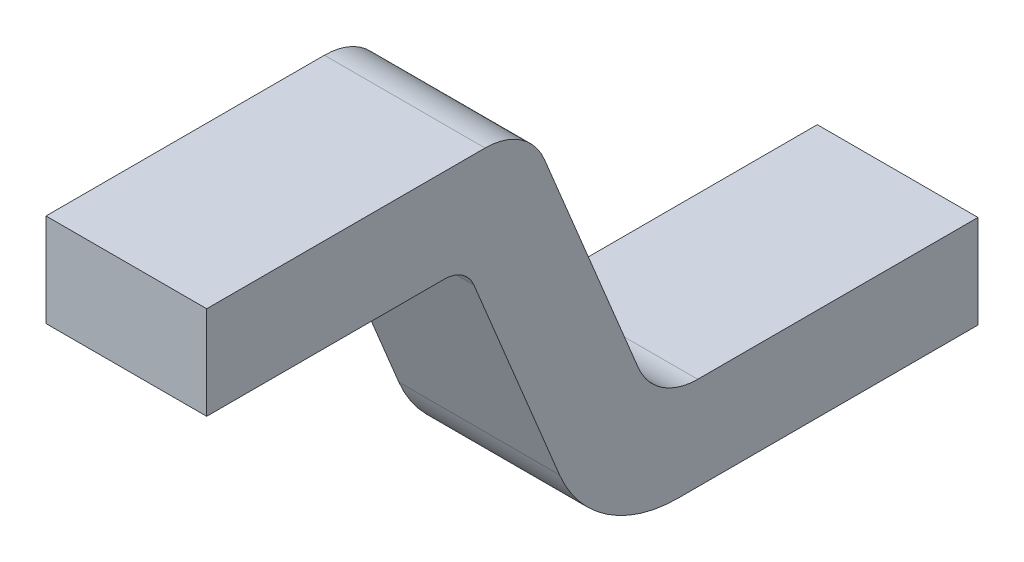
ISO-10303-21;
HEADER;
FILE_DESCRIPTION(('STEP AP214'),'2;1');
FILE_NAME('part.step','',(''),(''),'','','');
FILE_SCHEMA(('AUTOMOTIVE_DESIGN { 1 0 10303 214 1 1 1 1 }'));
ENDSEC;
DATA;
#1=APPLICATION_CONTEXT('core data for automotive mechanical design processes');
#2=APPLICATION_PROTOCOL_DEFINITION('international standard','automotive_design',2000,#1);
#3=PRODUCT_CONTEXT('',#1,'mechanical');
#4=PRODUCT('Part','Part','',(#3));
#5=PRODUCT_RELATED_PRODUCT_CATEGORY('part','',(#4));
#6=PRODUCT_DEFINITION_FORMATION('','',#4);
#7=PRODUCT_DEFINITION_CONTEXT('part definition',#1,'design');
#8=PRODUCT_DEFINITION('design','',#6,#7);
#9=PRODUCT_DEFINITION_SHAPE('','',#8);
#10=(LENGTH_UNIT() NAMED_UNIT(*) SI_UNIT(.MILLI.,.METRE.));
#11=(NAMED_UNIT(*) PLANE_ANGLE_UNIT() SI_UNIT($,.RADIAN.));
#12=(NAMED_UNIT(*) SI_UNIT($,.STERADIAN.) SOLID_ANGLE_UNIT());
#13=UNCERTAINTY_MEASURE_WITH_UNIT(LENGTH_MEASURE(1.E-05),#10,'distance_accuracy_value','');
#14=(GEOMETRIC_REPRESENTATION_CONTEXT(3) GLOBAL_UNCERTAINTY_ASSIGNED_CONTEXT((#13)) GLOBAL_UNIT_ASSIGNED_CONTEXT((#10,
#11,#12)) REPRESENTATION_CONTEXT('',''));
#15=CARTESIAN_POINT('',(0.,0.,0.));
#16=DIRECTION('',(0.,0.,1.));
#17=DIRECTION('',(1.,0.,0.));
#18=AXIS2_PLACEMENT_3D('',#15,#16,#17);
#19=CARTESIAN_POINT('',(0.25,-0.145,-0.169557608881));
#20=DIRECTION('',(0.,1.,0.));
#21=DIRECTION('',(0.,0.,-1.));
#22=AXIS2_PLACEMENT_3D('',#19,#20,#21);
#23=PLANE('',#22);
#24=DIRECTION('',(0.,0.,-1.));
#25=VECTOR('',#24,1.);
#26=CARTESIAN_POINT('',(0.,-0.145,-0.169557608881));
#27=LINE('',#26,#25);
#28=CARTESIAN_POINT('',(0.,-0.145,0.2));
#29=VERTEX_POINT('',#28);
#30=CARTESIAN_POINT('',(0.,-0.145,-0.169557608881));
#31=VERTEX_POINT('',#30);
#32=EDGE_CURVE('E11',#29,#31,#27,.T.);
#33=ORIENTED_EDGE('',*,*,#32,.T.);
#34=DIRECTION('',(-1.,0.,0.));
#35=VECTOR('',#34,1.);
#36=CARTESIAN_POINT('',(0.25,-0.145,-0.169557608881));
#37=LINE('',#36,#35);
#38=CARTESIAN_POINT('',(0.25,-0.145,-0.169557608881));
#39=VERTEX_POINT('',#38);
#40=EDGE_CURVE('E40',#39,#31,#37,.T.);
#41=ORIENTED_EDGE('',*,*,#40,.F.);
#42=DIRECTION('',(0.,0.,-1.));
#43=VECTOR('',#42,1.);
#44=CARTESIAN_POINT('',(0.25,-0.145,-0.169557608881));
#45=LINE('',#44,#43);
#46=CARTESIAN_POINT('',(0.25,-0.145,0.2));
#47=VERTEX_POINT('',#46);
#48=EDGE_CURVE('E205',#47,#39,#45,.T.);
#49=ORIENTED_EDGE('',*,*,#48,.F.);
#50=DIRECTION('',(1.,0.,0.));
#51=VECTOR('',#50,1.);
#52=CARTESIAN_POINT('',(0.,-0.145,0.2));
#53=LINE('',#52,#51);
#54=EDGE_CURVE('E176',#29,#47,#53,.T.);
#55=ORIENTED_EDGE('',*,*,#54,.F.);
#56=EDGE_LOOP('',(#33,#41,#49,#55));
#57=FACE_BOUND('',#56,.T.);
#58=ADVANCED_FACE('F16',(#57),#23,.F.);
#59=CARTESIAN_POINT('',(0.25,-0.195,-0.169557608881));
#60=DIRECTION('',(-1.,0.,0.));
#61=DIRECTION('',(0.,0.,1.));
#62=AXIS2_PLACEMENT_3D('',#59,#60,#61);
#63=CYLINDRICAL_SURFACE('',#62,0.05);
#64=CARTESIAN_POINT('',(0.,-0.195,-0.169557608881));
#65=DIRECTION('',(-1.,0.,0.));
#66=DIRECTION('',(0.,0.,-1.));
#67=AXIS2_PLACEMENT_3D('',#64,#65,#66);
#68=CIRCLE('',#67,0.05);
#69=CARTESIAN_POINT('',(0.,-0.175914153694,-0.215771572905));
#70=VERTEX_POINT('',#69);
#71=EDGE_CURVE('E26',#31,#70,#68,.T.);
#72=ORIENTED_EDGE('',*,*,#71,.T.);
#73=DIRECTION('',(-1.,0.,0.));
#74=VECTOR('',#73,1.);
#75=CARTESIAN_POINT('',(0.25,-0.175914153694,-0.215771572905));
#76=LINE('',#75,#74);
#77=CARTESIAN_POINT('',(0.25,-0.175914153694,-0.215771572905));
#78=VERTEX_POINT('',#77);
#79=EDGE_CURVE('E244',#78,#70,#76,.T.);
#80=ORIENTED_EDGE('',*,*,#79,.F.);
#81=CARTESIAN_POINT('',(0.25,-0.195,-0.169557608881));
#82=DIRECTION('',(-1.,0.,0.));
#83=DIRECTION('',(0.,0.,-1.));
#84=AXIS2_PLACEMENT_3D('',#81,#82,#83);
#85=CIRCLE('',#84,0.05);
#86=EDGE_CURVE('E194',#39,#78,#85,.T.);
#87=ORIENTED_EDGE('',*,*,#86,.F.);
#88=ORIENTED_EDGE('',*,*,#40,.T.);
#89=EDGE_LOOP('',(#72,#80,#87,#88));
#90=FACE_BOUND('',#89,.T.);
#91=ADVANCED_FACE('F307',(#90),#63,.F.);
#92=CARTESIAN_POINT('',(0.25,-0.498343385224,-0.348931211719));
#93=DIRECTION('',(0.,0.381716926120848,-0.92427928047363));
#94=DIRECTION('',(-1.,0.,0.));
#95=AXIS2_PLACEMENT_3D('',#92,#93,#94);
#96=PLANE('',#95);
#97=DIRECTION('',(0.,-0.92427928047363,-0.381716926120848));
#98=VECTOR('',#97,1.);
#99=CARTESIAN_POINT('',(0.,-0.498343385224,-0.348931211719));
#100=LINE('',#99,#98);
#101=CARTESIAN_POINT('',(0.,-0.498343385224,-0.348931211719));
#102=VERTEX_POINT('',#101);
#103=EDGE_CURVE('E241',#70,#102,#100,.T.);
#104=ORIENTED_EDGE('',*,*,#103,.T.);
#105=DIRECTION('',(-1.,0.,0.));
#106=VECTOR('',#105,1.);
#107=CARTESIAN_POINT('',(0.25,-0.498343385224,-0.348931211719));
#108=LINE('',#107,#106);
#109=CARTESIAN_POINT('',(0.25,-0.498343385224,-0.348931211719));
#110=VERTEX_POINT('',#109);
#111=EDGE_CURVE('E180',#110,#102,#108,.T.);
#112=ORIENTED_EDGE('',*,*,#111,.F.);
#113=DIRECTION('',(0.,-0.92427928047363,-0.381716926120848));
#114=VECTOR('',#113,1.);
#115=CARTESIAN_POINT('',(0.25,-0.498343385224,-0.348931211719));
#116=LINE('',#115,#114);
#117=EDGE_CURVE('E192',#78,#110,#116,.T.);
#118=ORIENTED_EDGE('',*,*,#117,.F.);
#119=ORIENTED_EDGE('',*,*,#79,.T.);
#120=EDGE_LOOP('',(#104,#112,#118,#119));
#121=FACE_BOUND('',#120,.T.);
#122=ADVANCED_FACE('F312',(#121),#96,.F.);
#123=CARTESIAN_POINT('',(0.25,-0.422,-0.533787067814));
#124=DIRECTION('',(-1.,0.,0.));
#125=DIRECTION('',(0.,0.,1.));
#126=AXIS2_PLACEMENT_3D('',#123,#124,#125);
#127=CYLINDRICAL_SURFACE('',#126,0.2);
#128=CARTESIAN_POINT('',(0.,-0.422,-0.533787067814));
#129=DIRECTION('',(1.,0.,0.));
#130=DIRECTION('',(0.,0.,1.));
#131=AXIS2_PLACEMENT_3D('',#128,#129,#130);
#132=CIRCLE('',#131,0.2);
#133=CARTESIAN_POINT('',(0.,-0.622,-0.533787067814));
#134=VERTEX_POINT('',#133);
#135=EDGE_CURVE('E262',#102,#134,#132,.T.);
#136=ORIENTED_EDGE('',*,*,#135,.T.);
#137=DIRECTION('',(-1.,0.,0.));
#138=VECTOR('',#137,1.);
#139=CARTESIAN_POINT('',(0.25,-0.622,-0.533787067814));
#140=LINE('',#139,#138);
#141=CARTESIAN_POINT('',(0.25,-0.622,-0.533787067814));
#142=VERTEX_POINT('',#141);
#143=EDGE_CURVE('E198',#142,#134,#140,.T.);
#144=ORIENTED_EDGE('',*,*,#143,.F.);
#145=CARTESIAN_POINT('',(0.25,-0.422,-0.533787067814));
#146=DIRECTION('',(1.,0.,0.));
#147=DIRECTION('',(0.,0.,1.));
#148=AXIS2_PLACEMENT_3D('',#145,#146,#147);
#149=CIRCLE('',#148,0.2);
#150=EDGE_CURVE('E19',#110,#142,#149,.T.);
#151=ORIENTED_EDGE('',*,*,#150,.F.);
#152=ORIENTED_EDGE('',*,*,#111,.T.);
#153=EDGE_LOOP('',(#136,#144,#151,#152));
#154=FACE_BOUND('',#153,.T.);
#155=ADVANCED_FACE('F327',(#154),#127,.T.);
#156=CARTESIAN_POINT('',(0.25,-0.622,-1.));
#157=DIRECTION('',(0.,1.,0.));
#158=DIRECTION('',(0.,0.,-1.));
#159=AXIS2_PLACEMENT_3D('',#156,#157,#158);
#160=PLANE('',#159);
#161=DIRECTION('',(0.,0.,-1.));
#162=VECTOR('',#161,1.);
#163=CARTESIAN_POINT('',(0.,-0.622,-1.));
#164=LINE('',#163,#162);
#165=CARTESIAN_POINT('',(0.,-0.622,-1.));
#166=VERTEX_POINT('',#165);
#167=EDGE_CURVE('E200',#134,#166,#164,.T.);
#168=ORIENTED_EDGE('',*,*,#167,.T.);
#169=DIRECTION('',(-1.,0.,0.));
#170=VECTOR('',#169,1.);
#171=CARTESIAN_POINT('',(0.25,-0.622,-1.));
#172=LINE('',#171,#170);
#173=CARTESIAN_POINT('',(0.25,-0.622,-1.));
#174=VERTEX_POINT('',#173);
#175=EDGE_CURVE('E125',#174,#166,#172,.T.);
#176=ORIENTED_EDGE('',*,*,#175,.F.);
#177=DIRECTION('',(0.,0.,-1.));
#178=VECTOR('',#177,1.);
#179=CARTESIAN_POINT('',(0.25,-0.622,-1.));
#180=LINE('',#179,#178);
#181=EDGE_CURVE('E133',#142,#174,#180,.T.);
#182=ORIENTED_EDGE('',*,*,#181,.F.);
#183=ORIENTED_EDGE('',*,*,#143,.T.);
#184=EDGE_LOOP('',(#168,#176,#182,#183));
#185=FACE_BOUND('',#184,.T.);
#186=ADVANCED_FACE('F330',(#185),#160,.F.);
#187=CARTESIAN_POINT('',(0.25,-0.477,-1.));
#188=DIRECTION('',(0.,0.,1.));
#189=DIRECTION('',(1.,0.,0.));
#190=AXIS2_PLACEMENT_3D('',#187,#188,#189);
#191=PLANE('',#190);
#192=DIRECTION('',(0.,1.,0.));
#193=VECTOR('',#192,1.);
#194=CARTESIAN_POINT('',(0.,-0.477,-1.));
#195=LINE('',#194,#193);
#196=CARTESIAN_POINT('',(0.,-0.477,-1.));
#197=VERTEX_POINT('',#196);
#198=EDGE_CURVE('E196',#166,#197,#195,.T.);
#199=ORIENTED_EDGE('',*,*,#198,.T.);
#200=DIRECTION('',(-1.,0.,0.));
#201=VECTOR('',#200,1.);
#202=CARTESIAN_POINT('',(0.25,-0.477,-1.));
#203=LINE('',#202,#201);
#204=CARTESIAN_POINT('',(0.25,-0.477,-1.));
#205=VERTEX_POINT('',#204);
#206=EDGE_CURVE('E268',#205,#197,#203,.T.);
#207=ORIENTED_EDGE('',*,*,#206,.F.);
#208=DIRECTION('',(0.,1.,0.));
#209=VECTOR('',#208,1.);
#210=CARTESIAN_POINT('',(0.25,-0.477,-1.));
#211=LINE('',#210,#209);
#212=EDGE_CURVE('E206',#174,#205,#211,.T.);
#213=ORIENTED_EDGE('',*,*,#212,.F.);
#214=ORIENTED_EDGE('',*,*,#175,.T.);
#215=EDGE_LOOP('',(#199,#207,#213,#214));
#216=FACE_BOUND('',#215,.T.);
#217=ADVANCED_FACE('F332',(#216),#191,.F.);
#218=CARTESIAN_POINT('',(0.25,-0.477,-0.563889158072));
#219=DIRECTION('',(0.,-1.,0.));
#220=DIRECTION('',(0.,0.,-1.));
#221=AXIS2_PLACEMENT_3D('',#218,#219,#220);
#222=PLANE('',#221);
#223=DIRECTION('',(0.,0.,1.));
#224=VECTOR('',#223,1.);
#225=CARTESIAN_POINT('',(0.,-0.477,-0.563889158072));
#226=LINE('',#225,#224);
#227=CARTESIAN_POINT('',(0.,-0.477,-0.563889158072));
#228=VERTEX_POINT('',#227);
#229=EDGE_CURVE('E226',#197,#228,#226,.T.);
#230=ORIENTED_EDGE('',*,*,#229,.T.);
#231=DIRECTION('',(-1.,0.,0.));
#232=VECTOR('',#231,1.);
#233=CARTESIAN_POINT('',(0.25,-0.477,-0.563889158072));
#234=LINE('',#233,#232);
#235=CARTESIAN_POINT('',(0.25,-0.477,-0.563889158072));
#236=VERTEX_POINT('',#235);
#237=EDGE_CURVE('E188',#236,#228,#234,.T.);
#238=ORIENTED_EDGE('',*,*,#237,.F.);
#239=DIRECTION('',(0.,0.,1.));
#240=VECTOR('',#239,1.);
#241=CARTESIAN_POINT('',(0.25,-0.477,-0.563889158072));
#242=LINE('',#241,#240);
#243=EDGE_CURVE('E208',#205,#236,#242,.T.);
#244=ORIENTED_EDGE('',*,*,#243,.F.);
#245=ORIENTED_EDGE('',*,*,#206,.T.);
#246=EDGE_LOOP('',(#230,#238,#244,#245));
#247=FACE_BOUND('',#246,.T.);
#248=ADVANCED_FACE('F334',(#247),#222,.F.);
#249=CARTESIAN_POINT('',(0.25,-0.377,-0.563889158072));
#250=DIRECTION('',(-1.,0.,0.));
#251=DIRECTION('',(0.,0.,1.));
#252=AXIS2_PLACEMENT_3D('',#249,#250,#251);
#253=CYLINDRICAL_SURFACE('',#252,0.1);
#254=CARTESIAN_POINT('',(0.,-0.377,-0.563889158072));
#255=DIRECTION('',(-1.,0.,0.));
#256=DIRECTION('',(0.,0.,-1.));
#257=AXIS2_PLACEMENT_3D('',#254,#255,#256);
#258=CIRCLE('',#257,0.1);
#259=CARTESIAN_POINT('',(0.,-0.415171692612,-0.471461230025));
#260=VERTEX_POINT('',#259);
#261=EDGE_CURVE('E191',#228,#260,#258,.T.);
#262=ORIENTED_EDGE('',*,*,#261,.T.);
#263=DIRECTION('',(-1.,0.,0.));
#264=VECTOR('',#263,1.);
#265=CARTESIAN_POINT('',(0.25,-0.415171692612,-0.471461230025));
#266=LINE('',#265,#264);
#267=CARTESIAN_POINT('',(0.25,-0.415171692612,-0.471461230025));
#268=VERTEX_POINT('',#267);
#269=EDGE_CURVE('E187',#268,#260,#266,.T.);
#270=ORIENTED_EDGE('',*,*,#269,.F.);
#271=CARTESIAN_POINT('',(0.25,-0.377,-0.563889158072));
#272=DIRECTION('',(-1.,0.,0.));
#273=DIRECTION('',(0.,0.,-1.));
#274=AXIS2_PLACEMENT_3D('',#271,#272,#273);
#275=CIRCLE('',#274,0.1);
#276=EDGE_CURVE('E148',#236,#268,#275,.T.);
#277=ORIENTED_EDGE('',*,*,#276,.F.);
#278=ORIENTED_EDGE('',*,*,#237,.T.);
#279=EDGE_LOOP('',(#262,#270,#277,#278));
#280=FACE_BOUND('',#279,.T.);
#281=ADVANCED_FACE('F335',(#280),#253,.F.);
#282=CARTESIAN_POINT('',(0.25,-0.06182830738789,-0.32553439414));
#283=DIRECTION('',(0.,-0.381716926120848,0.92427928047363));
#284=DIRECTION('',(-1.,0.,0.));
#285=AXIS2_PLACEMENT_3D('',#282,#283,#284);
#286=PLANE('',#285);
#287=DIRECTION('',(0.,0.92427928047363,0.381716926120848));
#288=VECTOR('',#287,1.);
#289=CARTESIAN_POINT('',(0.,-0.06182830738789,-0.32553439414));
#290=LINE('',#289,#288);
#291=CARTESIAN_POINT('',(0.,-0.06182830738789,-0.32553439414));
#292=VERTEX_POINT('',#291);
#293=EDGE_CURVE('E157',#260,#292,#290,.T.);
#294=ORIENTED_EDGE('',*,*,#293,.T.);
#295=DIRECTION('',(-1.,0.,0.));
#296=VECTOR('',#295,1.);
#297=CARTESIAN_POINT('',(0.25,-0.06182830738789,-0.32553439414));
#298=LINE('',#297,#296);
#299=CARTESIAN_POINT('',(0.25,-0.06182830738789,-0.32553439414));
#300=VERTEX_POINT('',#299);
#301=EDGE_CURVE('E154',#300,#292,#298,.T.);
#302=ORIENTED_EDGE('',*,*,#301,.F.);
#303=DIRECTION('',(0.,0.92427928047363,0.381716926120848));
#304=VECTOR('',#303,1.);
#305=CARTESIAN_POINT('',(0.25,-0.06182830738789,-0.32553439414));
#306=LINE('',#305,#304);
#307=EDGE_CURVE('E140',#268,#300,#306,.T.);
#308=ORIENTED_EDGE('',*,*,#307,.F.);
#309=ORIENTED_EDGE('',*,*,#269,.T.);
#310=EDGE_LOOP('',(#294,#302,#308,#309));
#311=FACE_BOUND('',#310,.T.);
#312=ADVANCED_FACE('F155',(#311),#286,.F.);
#313=CARTESIAN_POINT('',(0.25,-0.1,-0.233106466093));
#314=DIRECTION('',(-1.,0.,0.));
#315=DIRECTION('',(0.,0.,1.));
#316=AXIS2_PLACEMENT_3D('',#313,#314,#315);
#317=CYLINDRICAL_SURFACE('',#316,0.1);
#318=CARTESIAN_POINT('',(0.,-0.1,-0.233106466093));
#319=DIRECTION('',(1.,0.,0.));
#320=DIRECTION('',(0.,0.,1.));
#321=AXIS2_PLACEMENT_3D('',#318,#319,#320);
#322=CIRCLE('',#321,0.1);
#323=CARTESIAN_POINT('',(0.,0.,-0.233106466093));
#324=VERTEX_POINT('',#323);
#325=EDGE_CURVE('E162',#292,#324,#322,.T.);
#326=ORIENTED_EDGE('',*,*,#325,.T.);
#327=DIRECTION('',(-1.,0.,0.));
#328=VECTOR('',#327,1.);
#329=CARTESIAN_POINT('',(0.25,0.,-0.233106466093));
#330=LINE('',#329,#328);
#331=CARTESIAN_POINT('',(0.25,0.,-0.233106466093));
#332=VERTEX_POINT('',#331);
#333=EDGE_CURVE('E166',#332,#324,#330,.T.);
#334=ORIENTED_EDGE('',*,*,#333,.F.);
#335=CARTESIAN_POINT('',(0.25,-0.1,-0.233106466093));
#336=DIRECTION('',(1.,0.,0.));
#337=DIRECTION('',(0.,0.,1.));
#338=AXIS2_PLACEMENT_3D('',#335,#336,#337);
#339=CIRCLE('',#338,0.1);
#340=EDGE_CURVE('E145',#300,#332,#339,.T.);
#341=ORIENTED_EDGE('',*,*,#340,.F.);
#342=ORIENTED_EDGE('',*,*,#301,.T.);
#343=EDGE_LOOP('',(#326,#334,#341,#342));
#344=FACE_BOUND('',#343,.T.);
#345=ADVANCED_FACE('F165',(#344),#317,.T.);
#346=CARTESIAN_POINT('',(0.25,0.,0.));
#347=DIRECTION('',(0.,-1.,0.));
#348=DIRECTION('',(0.,0.,-1.));
#349=AXIS2_PLACEMENT_3D('',#346,#347,#348);
#350=PLANE('',#349);
#351=DIRECTION('',(0.,0.,1.));
#352=VECTOR('',#351,1.);
#353=CARTESIAN_POINT('',(0.,0.,0.));
#354=LINE('',#353,#352);
#355=CARTESIAN_POINT('',(0.,0.,0.2));
#356=VERTEX_POINT('',#355);
#357=EDGE_CURVE('E163',#324,#356,#354,.T.);
#358=ORIENTED_EDGE('',*,*,#357,.T.);
#359=DIRECTION('',(-1.,0.,0.));
#360=VECTOR('',#359,1.);
#361=CARTESIAN_POINT('',(0.,0.,0.2));
#362=LINE('',#361,#360);
#363=CARTESIAN_POINT('',(0.25,0.,0.2));
#364=VERTEX_POINT('',#363);
#365=EDGE_CURVE('E282',#364,#356,#362,.T.);
#366=ORIENTED_EDGE('',*,*,#365,.F.);
#367=DIRECTION('',(0.,0.,1.));
#368=VECTOR('',#367,1.);
#369=CARTESIAN_POINT('',(0.25,0.,0.));
#370=LINE('',#369,#368);
#371=EDGE_CURVE('E203',#332,#364,#370,.T.);
#372=ORIENTED_EDGE('',*,*,#371,.F.);
#373=ORIENTED_EDGE('',*,*,#333,.T.);
#374=EDGE_LOOP('',(#358,#366,#372,#373));
#375=FACE_BOUND('',#374,.T.);
#376=ADVANCED_FACE('F295',(#375),#350,.F.);
#377=CARTESIAN_POINT('',(0.25,-0.1,-0.233106466093));
#378=DIRECTION('',(-1.,0.,0.));
#379=DIRECTION('',(0.,0.,1.));
#380=AXIS2_PLACEMENT_3D('',#377,#378,#379);
#381=PLANE('',#380);
#382=ORIENTED_EDGE('',*,*,#371,.T.);
#383=DIRECTION('',(0.,1.,0.));
#384=VECTOR('',#383,1.);
#385=CARTESIAN_POINT('',(0.25,0.,0.2));
#386=LINE('',#385,#384);
#387=EDGE_CURVE('E184',#47,#364,#386,.T.);
#388=ORIENTED_EDGE('',*,*,#387,.F.);
#389=ORIENTED_EDGE('',*,*,#48,.T.);
#390=ORIENTED_EDGE('',*,*,#86,.T.);
#391=ORIENTED_EDGE('',*,*,#117,.T.);
#392=ORIENTED_EDGE('',*,*,#150,.T.);
#393=ORIENTED_EDGE('',*,*,#181,.T.);
#394=ORIENTED_EDGE('',*,*,#212,.T.);
#395=ORIENTED_EDGE('',*,*,#243,.T.);
#396=ORIENTED_EDGE('',*,*,#276,.T.);
#397=ORIENTED_EDGE('',*,*,#307,.T.);
#398=ORIENTED_EDGE('',*,*,#340,.T.);
#399=EDGE_LOOP('',(#382,#388,#389,#390,#391,#392,#393,#394,#395,#396,#397,#398));
#400=FACE_BOUND('',#399,.T.);
#401=ADVANCED_FACE('F143',(#400),#381,.F.);
#402=CARTESIAN_POINT('',(0.,-0.1,-0.233106466093));
#403=DIRECTION('',(-1.,0.,0.));
#404=DIRECTION('',(0.,0.,1.));
#405=AXIS2_PLACEMENT_3D('',#402,#403,#404);
#406=PLANE('',#405);
#407=ORIENTED_EDGE('',*,*,#32,.F.);
#408=DIRECTION('',(0.,-1.,0.));
#409=VECTOR('',#408,1.);
#410=CARTESIAN_POINT('',(0.,0.,0.2));
#411=LINE('',#410,#409);
#412=EDGE_CURVE('E169',#356,#29,#411,.T.);
#413=ORIENTED_EDGE('',*,*,#412,.F.);
#414=ORIENTED_EDGE('',*,*,#357,.F.);
#415=ORIENTED_EDGE('',*,*,#325,.F.);
#416=ORIENTED_EDGE('',*,*,#293,.F.);
#417=ORIENTED_EDGE('',*,*,#261,.F.);
#418=ORIENTED_EDGE('',*,*,#229,.F.);
#419=ORIENTED_EDGE('',*,*,#198,.F.);
#420=ORIENTED_EDGE('',*,*,#167,.F.);
#421=ORIENTED_EDGE('',*,*,#135,.F.);
#422=ORIENTED_EDGE('',*,*,#103,.F.);
#423=ORIENTED_EDGE('',*,*,#71,.F.);
#424=EDGE_LOOP('',(#407,#413,#414,#415,#416,#417,#418,#419,#420,#421,#422,#423));
#425=FACE_BOUND('',#424,.T.);
#426=ADVANCED_FACE('F302',(#425),#406,.T.);
#427=CARTESIAN_POINT('',(0.,-0.145,0.2));
#428=DIRECTION('',(0.,0.,1.));
#429=DIRECTION('',(1.,0.,0.));
#430=AXIS2_PLACEMENT_3D('',#427,#428,#429);
#431=PLANE('',#430);
#432=ORIENTED_EDGE('',*,*,#412,.T.);
#433=ORIENTED_EDGE('',*,*,#54,.T.);
#434=ORIENTED_EDGE('',*,*,#387,.T.);
#435=ORIENTED_EDGE('',*,*,#365,.T.);
#436=EDGE_LOOP('',(#432,#433,#434,#435));
#437=FACE_BOUND('',#436,.T.);
#438=ADVANCED_FACE('F292',(#437),#431,.T.);
#439=CLOSED_SHELL('',(#58,#91,#122,#155,#186,#217,#248,#281,#312,#345,#376,#401,#426,#438));
#440=MANIFOLD_SOLID_BREP('B1',#439);
#441=ADVANCED_BREP_SHAPE_REPRESENTATION('',(#18,#440),#14);
#442=SHAPE_DEFINITION_REPRESENTATION(#9,#441);
ENDSEC;
END-ISO-10303-21;
